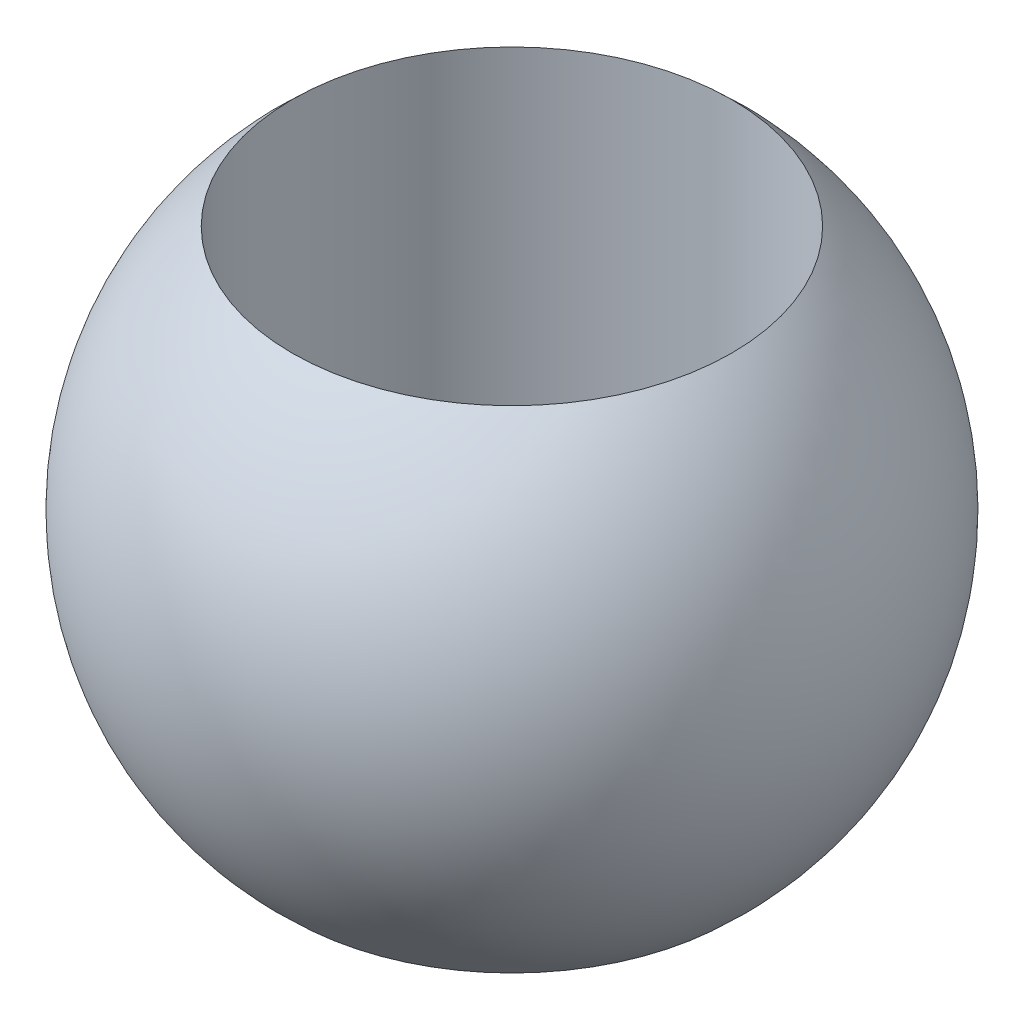
ISO-10303-21;
HEADER;
FILE_DESCRIPTION(('STEP AP214'),'2;1');
FILE_NAME('part.step','',(''),(''),'','','');
FILE_SCHEMA(('AUTOMOTIVE_DESIGN { 1 0 10303 214 1 1 1 1 }'));
ENDSEC;
DATA;
#1=APPLICATION_CONTEXT('core data for automotive mechanical design processes');
#2=APPLICATION_PROTOCOL_DEFINITION('international standard','automotive_design',2000,#1);
#3=PRODUCT_CONTEXT('',#1,'mechanical');
#4=PRODUCT('Part','Part','',(#3));
#5=PRODUCT_RELATED_PRODUCT_CATEGORY('part','',(#4));
#6=PRODUCT_DEFINITION_FORMATION('','',#4);
#7=PRODUCT_DEFINITION_CONTEXT('part definition',#1,'design');
#8=PRODUCT_DEFINITION('design','',#6,#7);
#9=PRODUCT_DEFINITION_SHAPE('','',#8);
#10=(LENGTH_UNIT() NAMED_UNIT(*) SI_UNIT(.MILLI.,.METRE.));
#11=(NAMED_UNIT(*) PLANE_ANGLE_UNIT() SI_UNIT($,.RADIAN.));
#12=(NAMED_UNIT(*) SI_UNIT($,.STERADIAN.) SOLID_ANGLE_UNIT());
#13=UNCERTAINTY_MEASURE_WITH_UNIT(LENGTH_MEASURE(1.E-05),#10,'distance_accuracy_value','');
#14=(GEOMETRIC_REPRESENTATION_CONTEXT(3) GLOBAL_UNCERTAINTY_ASSIGNED_CONTEXT((#13)) GLOBAL_UNIT_ASSIGNED_CONTEXT((#10,
#11,#12)) REPRESENTATION_CONTEXT('',''));
#15=CARTESIAN_POINT('',(0.,0.,0.));
#16=DIRECTION('',(0.,0.,1.));
#17=DIRECTION('',(1.,0.,0.));
#18=AXIS2_PLACEMENT_3D('',#15,#16,#17);
#19=CARTESIAN_POINT('',(0.,0.,0.));
#20=DIRECTION('',(0.,1.,0.));
#21=DIRECTION('',(1.,0.,0.));
#22=AXIS2_PLACEMENT_3D('',#19,#20,#21);
#23=SPHERICAL_SURFACE('',#22,3.);
#24=CARTESIAN_POINT('',(0.,2.23606797749979,0.));
#25=DIRECTION('',(0.,-1.,0.));
#26=DIRECTION('',(0.,0.,-1.));
#27=AXIS2_PLACEMENT_3D('',#24,#25,#26);
#28=CIRCLE('',#27,2.);
#29=CARTESIAN_POINT('',(0.,2.23606797749979,-2.));
#30=VERTEX_POINT('',#29);
#31=EDGE_CURVE('E45',#30,#30,#28,.F.);
#32=ORIENTED_EDGE('',*,*,#31,.F.);
#33=EDGE_LOOP('',(#32));
#34=FACE_BOUND('',#33,.T.);
#35=CARTESIAN_POINT('',(0.,-2.23606797749979,0.));
#36=DIRECTION('',(0.,1.,0.));
#37=DIRECTION('',(0.,0.,1.));
#38=AXIS2_PLACEMENT_3D('',#35,#36,#37);
#39=CIRCLE('',#38,2.);
#40=CARTESIAN_POINT('',(0.,-2.23606797749979,2.));
#41=VERTEX_POINT('',#40);
#42=EDGE_CURVE('E10',#41,#41,#39,.F.);
#43=ORIENTED_EDGE('',*,*,#42,.F.);
#44=EDGE_LOOP('',(#43));
#45=FACE_BOUND('',#44,.T.);
#46=ADVANCED_FACE('F38',(#34,#45),#23,.T.);
#47=CARTESIAN_POINT('',(0.,10.,0.));
#48=DIRECTION('',(0.,-1.,0.));
#49=DIRECTION('',(0.,0.,-1.));
#50=AXIS2_PLACEMENT_3D('',#47,#48,#49);
#51=CYLINDRICAL_SURFACE('',#50,2.);
#52=ORIENTED_EDGE('',*,*,#31,.T.);
#53=EDGE_LOOP('',(#52));
#54=FACE_BOUND('',#53,.T.);
#55=ORIENTED_EDGE('',*,*,#42,.T.);
#56=EDGE_LOOP('',(#55));
#57=FACE_BOUND('',#56,.T.);
#58=ADVANCED_FACE('F52',(#54,#57),#51,.F.);
#59=CLOSED_SHELL('',(#46,#58));
#60=MANIFOLD_SOLID_BREP('B2',#59);
#61=ADVANCED_BREP_SHAPE_REPRESENTATION('',(#18,#60),#14);
#62=SHAPE_DEFINITION_REPRESENTATION(#9,#61);
ENDSEC;
END-ISO-10303-21;
